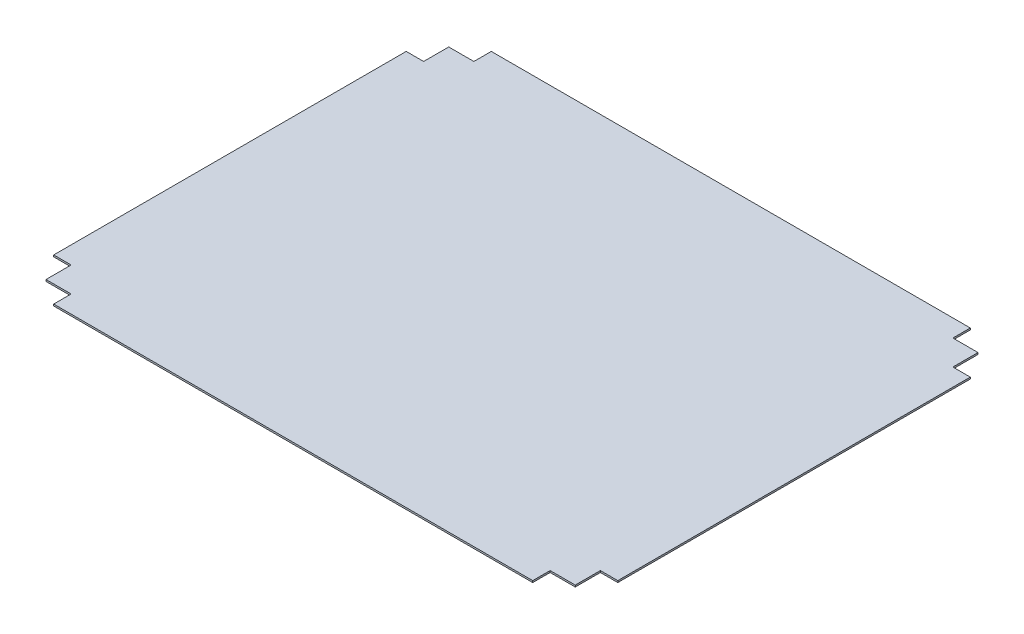
ISO-10303-21;
HEADER;
FILE_DESCRIPTION(('STEP AP214'),'2;1');
FILE_NAME('part.step','',(''),(''),'','','');
FILE_SCHEMA(('AUTOMOTIVE_DESIGN { 1 0 10303 214 1 1 1 1 }'));
ENDSEC;
DATA;
#1=APPLICATION_CONTEXT('core data for automotive mechanical design processes');
#2=APPLICATION_PROTOCOL_DEFINITION('international standard','automotive_design',2000,#1);
#3=PRODUCT_CONTEXT('',#1,'mechanical');
#4=PRODUCT('Part','Part','',(#3));
#5=PRODUCT_RELATED_PRODUCT_CATEGORY('part','',(#4));
#6=PRODUCT_DEFINITION_FORMATION('','',#4);
#7=PRODUCT_DEFINITION_CONTEXT('part definition',#1,'design');
#8=PRODUCT_DEFINITION('design','',#6,#7);
#9=PRODUCT_DEFINITION_SHAPE('','',#8);
#10=(LENGTH_UNIT() NAMED_UNIT(*) SI_UNIT(.MILLI.,.METRE.));
#11=(NAMED_UNIT(*) PLANE_ANGLE_UNIT() SI_UNIT($,.RADIAN.));
#12=(NAMED_UNIT(*) SI_UNIT($,.STERADIAN.) SOLID_ANGLE_UNIT());
#13=UNCERTAINTY_MEASURE_WITH_UNIT(LENGTH_MEASURE(1.E-05),#10,'distance_accuracy_value','');
#14=(GEOMETRIC_REPRESENTATION_CONTEXT(3) GLOBAL_UNCERTAINTY_ASSIGNED_CONTEXT((#13)) GLOBAL_UNIT_ASSIGNED_CONTEXT((#10,
#11,#12)) REPRESENTATION_CONTEXT('',''));
#15=CARTESIAN_POINT('',(0.,0.,0.));
#16=DIRECTION('',(0.,0.,1.));
#17=DIRECTION('',(1.,0.,0.));
#18=AXIS2_PLACEMENT_3D('',#15,#16,#17);
#19=CARTESIAN_POINT('',(276.401533303744,2.,252.500218509708));
#20=DIRECTION('',(0.,0.,-1.));
#21=DIRECTION('',(-1.,0.,0.));
#22=AXIS2_PLACEMENT_3D('',#19,#20,#21);
#23=PLANE('',#22);
#24=DIRECTION('',(1.,0.,0.));
#25=VECTOR('',#24,1.);
#26=CARTESIAN_POINT('',(276.401533303744,0.,252.500218509708));
#27=LINE('',#26,#25);
#28=CARTESIAN_POINT('',(-276.399781490292,0.,252.500218509709));
#29=VERTEX_POINT('',#28);
#30=CARTESIAN_POINT('',(276.401533303744,0.,252.500218509708));
#31=VERTEX_POINT('',#30);
#32=EDGE_CURVE('E201',#29,#31,#27,.T.);
#33=ORIENTED_EDGE('',*,*,#32,.T.);
#34=DIRECTION('',(0.,-1.,0.));
#35=VECTOR('',#34,1.);
#36=CARTESIAN_POINT('',(276.401533303744,2.,252.500218509708));
#37=LINE('',#36,#35);
#38=CARTESIAN_POINT('',(276.401533303744,2.,252.500218509708));
#39=VERTEX_POINT('',#38);
#40=EDGE_CURVE('E11',#39,#31,#37,.T.);
#41=ORIENTED_EDGE('',*,*,#40,.F.);
#42=DIRECTION('',(1.,0.,0.));
#43=VECTOR('',#42,1.);
#44=CARTESIAN_POINT('',(276.401533303744,2.,252.500218509708));
#45=LINE('',#44,#43);
#46=CARTESIAN_POINT('',(-276.399781490292,2.,252.500218509709));
#47=VERTEX_POINT('',#46);
#48=EDGE_CURVE('E239',#47,#39,#45,.T.);
#49=ORIENTED_EDGE('',*,*,#48,.F.);
#50=DIRECTION('',(0.,-1.,0.));
#51=VECTOR('',#50,1.);
#52=CARTESIAN_POINT('',(-276.399781490292,2.,252.500218509709));
#53=LINE('',#52,#51);
#54=EDGE_CURVE('E197',#47,#29,#53,.T.);
#55=ORIENTED_EDGE('',*,*,#54,.T.);
#56=EDGE_LOOP('',(#33,#41,#49,#55));
#57=FACE_BOUND('',#56,.T.);
#58=ADVANCED_FACE('F33',(#57),#23,.F.);
#59=CARTESIAN_POINT('',(276.401533303744,2.,232.401081901545));
#60=DIRECTION('',(-1.,0.,0.));
#61=DIRECTION('',(0.,0.,1.));
#62=AXIS2_PLACEMENT_3D('',#59,#60,#61);
#63=PLANE('',#62);
#64=DIRECTION('',(0.,0.,-1.));
#65=VECTOR('',#64,1.);
#66=CARTESIAN_POINT('',(276.401533303744,0.,232.401081901545));
#67=LINE('',#66,#65);
#68=CARTESIAN_POINT('',(276.401533303744,0.,232.401081901545));
#69=VERTEX_POINT('',#68);
#70=EDGE_CURVE('E204',#31,#69,#67,.T.);
#71=ORIENTED_EDGE('',*,*,#70,.T.);
#72=DIRECTION('',(0.,-1.,0.));
#73=VECTOR('',#72,1.);
#74=CARTESIAN_POINT('',(276.401533303744,2.,232.401081901545));
#75=LINE('',#74,#73);
#76=CARTESIAN_POINT('',(276.401533303744,2.,232.401081901545));
#77=VERTEX_POINT('',#76);
#78=EDGE_CURVE('E41',#77,#69,#75,.T.);
#79=ORIENTED_EDGE('',*,*,#78,.F.);
#80=DIRECTION('',(0.,0.,-1.));
#81=VECTOR('',#80,1.);
#82=CARTESIAN_POINT('',(276.401533303744,2.,232.401081901545));
#83=LINE('',#82,#81);
#84=EDGE_CURVE('E128',#39,#77,#83,.T.);
#85=ORIENTED_EDGE('',*,*,#84,.F.);
#86=ORIENTED_EDGE('',*,*,#40,.T.);
#87=EDGE_LOOP('',(#71,#79,#85,#86));
#88=FACE_BOUND('',#87,.T.);
#89=ADVANCED_FACE('F357',(#88),#63,.F.);
#90=CARTESIAN_POINT('',(305.401533303744,2.,232.401081901545));
#91=DIRECTION('',(0.,0.,-1.));
#92=DIRECTION('',(-1.,0.,0.));
#93=AXIS2_PLACEMENT_3D('',#90,#91,#92);
#94=PLANE('',#93);
#95=DIRECTION('',(1.,0.,0.));
#96=VECTOR('',#95,1.);
#97=CARTESIAN_POINT('',(305.401533303744,0.,232.401081901545));
#98=LINE('',#97,#96);
#99=CARTESIAN_POINT('',(305.401533303744,0.,232.401081901545));
#100=VERTEX_POINT('',#99);
#101=EDGE_CURVE('E206',#69,#100,#98,.T.);
#102=ORIENTED_EDGE('',*,*,#101,.T.);
#103=DIRECTION('',(0.,-1.,0.));
#104=VECTOR('',#103,1.);
#105=CARTESIAN_POINT('',(305.401533303744,2.,232.401081901545));
#106=LINE('',#105,#104);
#107=CARTESIAN_POINT('',(305.401533303744,2.,232.401081901545));
#108=VERTEX_POINT('',#107);
#109=EDGE_CURVE('E282',#108,#100,#106,.T.);
#110=ORIENTED_EDGE('',*,*,#109,.F.);
#111=DIRECTION('',(1.,0.,0.));
#112=VECTOR('',#111,1.);
#113=CARTESIAN_POINT('',(305.401533303744,2.,232.401081901545));
#114=LINE('',#113,#112);
#115=EDGE_CURVE('E290',#77,#108,#114,.T.);
#116=ORIENTED_EDGE('',*,*,#115,.F.);
#117=ORIENTED_EDGE('',*,*,#78,.T.);
#118=EDGE_LOOP('',(#102,#110,#116,#117));
#119=FACE_BOUND('',#118,.T.);
#120=ADVANCED_FACE('F288',(#119),#94,.F.);
#121=CARTESIAN_POINT('',(305.401533303744,2.,203.401081901545));
#122=DIRECTION('',(-1.,0.,0.));
#123=DIRECTION('',(0.,0.,1.));
#124=AXIS2_PLACEMENT_3D('',#121,#122,#123);
#125=PLANE('',#124);
#126=DIRECTION('',(0.,0.,-1.));
#127=VECTOR('',#126,1.);
#128=CARTESIAN_POINT('',(305.401533303744,0.,203.401081901545));
#129=LINE('',#128,#127);
#130=CARTESIAN_POINT('',(305.401533303744,0.,203.401081901545));
#131=VERTEX_POINT('',#130);
#132=EDGE_CURVE('E208',#100,#131,#129,.T.);
#133=ORIENTED_EDGE('',*,*,#132,.T.);
#134=DIRECTION('',(0.,-1.,0.));
#135=VECTOR('',#134,1.);
#136=CARTESIAN_POINT('',(305.401533303744,2.,203.401081901545));
#137=LINE('',#136,#135);
#138=CARTESIAN_POINT('',(305.401533303744,2.,203.401081901545));
#139=VERTEX_POINT('',#138);
#140=EDGE_CURVE('E279',#139,#131,#137,.T.);
#141=ORIENTED_EDGE('',*,*,#140,.F.);
#142=DIRECTION('',(0.,0.,-1.));
#143=VECTOR('',#142,1.);
#144=CARTESIAN_POINT('',(305.401533303744,2.,203.401081901545));
#145=LINE('',#144,#143);
#146=EDGE_CURVE('E308',#108,#139,#145,.T.);
#147=ORIENTED_EDGE('',*,*,#146,.F.);
#148=ORIENTED_EDGE('',*,*,#109,.T.);
#149=EDGE_LOOP('',(#133,#141,#147,#148));
#150=FACE_BOUND('',#149,.T.);
#151=ADVANCED_FACE('F299',(#150),#125,.F.);
#152=CARTESIAN_POINT('',(325.500218509709,2.,203.401081901545));
#153=DIRECTION('',(0.,0.,-1.));
#154=DIRECTION('',(-1.,0.,0.));
#155=AXIS2_PLACEMENT_3D('',#152,#153,#154);
#156=PLANE('',#155);
#157=DIRECTION('',(1.,0.,0.));
#158=VECTOR('',#157,1.);
#159=CARTESIAN_POINT('',(325.500218509709,0.,203.401081901545));
#160=LINE('',#159,#158);
#161=CARTESIAN_POINT('',(325.500218509709,0.,203.401081901545));
#162=VERTEX_POINT('',#161);
#163=EDGE_CURVE('E210',#131,#162,#160,.T.);
#164=ORIENTED_EDGE('',*,*,#163,.T.);
#165=DIRECTION('',(0.,-1.,0.));
#166=VECTOR('',#165,1.);
#167=CARTESIAN_POINT('',(325.500218509709,2.,203.401081901545));
#168=LINE('',#167,#166);
#169=CARTESIAN_POINT('',(325.500218509709,2.,203.401081901545));
#170=VERTEX_POINT('',#169);
#171=EDGE_CURVE('E276',#170,#162,#168,.T.);
#172=ORIENTED_EDGE('',*,*,#171,.F.);
#173=DIRECTION('',(1.,0.,0.));
#174=VECTOR('',#173,1.);
#175=CARTESIAN_POINT('',(325.500218509709,2.,203.401081901545));
#176=LINE('',#175,#174);
#177=EDGE_CURVE('E305',#139,#170,#176,.T.);
#178=ORIENTED_EDGE('',*,*,#177,.F.);
#179=ORIENTED_EDGE('',*,*,#140,.T.);
#180=EDGE_LOOP('',(#164,#172,#178,#179));
#181=FACE_BOUND('',#180,.T.);
#182=ADVANCED_FACE('F303',(#181),#156,.F.);
#183=CARTESIAN_POINT('',(325.500218509708,2.,-203.401101301539));
#184=DIRECTION('',(-1.,0.,0.));
#185=DIRECTION('',(0.,0.,1.));
#186=AXIS2_PLACEMENT_3D('',#183,#184,#185);
#187=PLANE('',#186);
#188=DIRECTION('',(0.,0.,-1.));
#189=VECTOR('',#188,1.);
#190=CARTESIAN_POINT('',(325.500218509708,0.,-203.401101301539));
#191=LINE('',#190,#189);
#192=CARTESIAN_POINT('',(325.500218509708,0.,-203.401101301539));
#193=VERTEX_POINT('',#192);
#194=EDGE_CURVE('E212',#162,#193,#191,.T.);
#195=ORIENTED_EDGE('',*,*,#194,.T.);
#196=DIRECTION('',(0.,-1.,0.));
#197=VECTOR('',#196,1.);
#198=CARTESIAN_POINT('',(325.500218509708,2.,-203.401101301539));
#199=LINE('',#198,#197);
#200=CARTESIAN_POINT('',(325.500218509708,2.,-203.401101301539));
#201=VERTEX_POINT('',#200);
#202=EDGE_CURVE('E273',#201,#193,#199,.T.);
#203=ORIENTED_EDGE('',*,*,#202,.F.);
#204=DIRECTION('',(0.,0.,-1.));
#205=VECTOR('',#204,1.);
#206=CARTESIAN_POINT('',(325.500218509708,2.,-203.401101301539));
#207=LINE('',#206,#205);
#208=EDGE_CURVE('E307',#170,#201,#207,.T.);
#209=ORIENTED_EDGE('',*,*,#208,.F.);
#210=ORIENTED_EDGE('',*,*,#171,.T.);
#211=EDGE_LOOP('',(#195,#203,#209,#210));
#212=FACE_BOUND('',#211,.T.);
#213=ADVANCED_FACE('F370',(#212),#187,.F.);
#214=CARTESIAN_POINT('',(305.401533303743,2.,-203.401101301539));
#215=DIRECTION('',(0.,0.,1.));
#216=DIRECTION('',(1.,0.,0.));
#217=AXIS2_PLACEMENT_3D('',#214,#215,#216);
#218=PLANE('',#217);
#219=DIRECTION('',(-1.,0.,0.));
#220=VECTOR('',#219,1.);
#221=CARTESIAN_POINT('',(305.401533303743,0.,-203.401101301539));
#222=LINE('',#221,#220);
#223=CARTESIAN_POINT('',(305.401533303743,0.,-203.401101301539));
#224=VERTEX_POINT('',#223);
#225=EDGE_CURVE('E214',#193,#224,#222,.T.);
#226=ORIENTED_EDGE('',*,*,#225,.T.);
#227=DIRECTION('',(0.,-1.,0.));
#228=VECTOR('',#227,1.);
#229=CARTESIAN_POINT('',(305.401533303743,2.,-203.401101301539));
#230=LINE('',#229,#228);
#231=CARTESIAN_POINT('',(305.401533303743,2.,-203.401101301539));
#232=VERTEX_POINT('',#231);
#233=EDGE_CURVE('E270',#232,#224,#230,.T.);
#234=ORIENTED_EDGE('',*,*,#233,.F.);
#235=DIRECTION('',(-1.,0.,0.));
#236=VECTOR('',#235,1.);
#237=CARTESIAN_POINT('',(305.401533303743,2.,-203.401101301539));
#238=LINE('',#237,#236);
#239=EDGE_CURVE('E310',#201,#232,#238,.T.);
#240=ORIENTED_EDGE('',*,*,#239,.F.);
#241=ORIENTED_EDGE('',*,*,#202,.T.);
#242=EDGE_LOOP('',(#226,#234,#240,#241));
#243=FACE_BOUND('',#242,.T.);
#244=ADVANCED_FACE('F373',(#243),#218,.F.);
#245=CARTESIAN_POINT('',(305.401533303743,2.,-232.401101301539));
#246=DIRECTION('',(-1.,0.,0.));
#247=DIRECTION('',(0.,0.,1.));
#248=AXIS2_PLACEMENT_3D('',#245,#246,#247);
#249=PLANE('',#248);
#250=DIRECTION('',(0.,0.,-1.));
#251=VECTOR('',#250,1.);
#252=CARTESIAN_POINT('',(305.401533303743,0.,-232.401101301539));
#253=LINE('',#252,#251);
#254=CARTESIAN_POINT('',(305.401533303743,0.,-232.401101301539));
#255=VERTEX_POINT('',#254);
#256=EDGE_CURVE('E216',#224,#255,#253,.T.);
#257=ORIENTED_EDGE('',*,*,#256,.T.);
#258=DIRECTION('',(0.,-1.,0.));
#259=VECTOR('',#258,1.);
#260=CARTESIAN_POINT('',(305.401533303743,2.,-232.401101301539));
#261=LINE('',#260,#259);
#262=CARTESIAN_POINT('',(305.401533303743,2.,-232.401101301539));
#263=VERTEX_POINT('',#262);
#264=EDGE_CURVE('E267',#263,#255,#261,.T.);
#265=ORIENTED_EDGE('',*,*,#264,.F.);
#266=DIRECTION('',(0.,0.,-1.));
#267=VECTOR('',#266,1.);
#268=CARTESIAN_POINT('',(305.401533303743,2.,-232.401101301539));
#269=LINE('',#268,#267);
#270=EDGE_CURVE('E316',#232,#263,#269,.T.);
#271=ORIENTED_EDGE('',*,*,#270,.F.);
#272=ORIENTED_EDGE('',*,*,#233,.T.);
#273=EDGE_LOOP('',(#257,#265,#271,#272));
#274=FACE_BOUND('',#273,.T.);
#275=ADVANCED_FACE('F377',(#274),#249,.F.);
#276=CARTESIAN_POINT('',(276.401533303743,2.,-232.401101301539));
#277=DIRECTION('',(0.,0.,1.));
#278=DIRECTION('',(1.,0.,0.));
#279=AXIS2_PLACEMENT_3D('',#276,#277,#278);
#280=PLANE('',#279);
#281=DIRECTION('',(-1.,0.,0.));
#282=VECTOR('',#281,1.);
#283=CARTESIAN_POINT('',(276.401533303743,0.,-232.401101301539));
#284=LINE('',#283,#282);
#285=CARTESIAN_POINT('',(276.401533303743,0.,-232.401101301539));
#286=VERTEX_POINT('',#285);
#287=EDGE_CURVE('E218',#255,#286,#284,.T.);
#288=ORIENTED_EDGE('',*,*,#287,.T.);
#289=DIRECTION('',(0.,-1.,0.));
#290=VECTOR('',#289,1.);
#291=CARTESIAN_POINT('',(276.401533303743,2.,-232.401101301539));
#292=LINE('',#291,#290);
#293=CARTESIAN_POINT('',(276.401533303743,2.,-232.401101301539));
#294=VERTEX_POINT('',#293);
#295=EDGE_CURVE('E264',#294,#286,#292,.T.);
#296=ORIENTED_EDGE('',*,*,#295,.F.);
#297=DIRECTION('',(-1.,0.,0.));
#298=VECTOR('',#297,1.);
#299=CARTESIAN_POINT('',(276.401533303743,2.,-232.401101301539));
#300=LINE('',#299,#298);
#301=EDGE_CURVE('E318',#263,#294,#300,.T.);
#302=ORIENTED_EDGE('',*,*,#301,.F.);
#303=ORIENTED_EDGE('',*,*,#264,.T.);
#304=EDGE_LOOP('',(#288,#296,#302,#303));
#305=FACE_BOUND('',#304,.T.);
#306=ADVANCED_FACE('F381',(#305),#280,.F.);
#307=CARTESIAN_POINT('',(276.401533303744,2.,-252.500218509708));
#308=DIRECTION('',(-1.,0.,0.));
#309=DIRECTION('',(0.,0.,1.));
#310=AXIS2_PLACEMENT_3D('',#307,#308,#309);
#311=PLANE('',#310);
#312=DIRECTION('',(0.,0.,-1.));
#313=VECTOR('',#312,1.);
#314=CARTESIAN_POINT('',(276.401533303744,0.,-252.500218509708));
#315=LINE('',#314,#313);
#316=CARTESIAN_POINT('',(276.401533303744,0.,-252.500218509708));
#317=VERTEX_POINT('',#316);
#318=EDGE_CURVE('E220',#286,#317,#315,.T.);
#319=ORIENTED_EDGE('',*,*,#318,.T.);
#320=DIRECTION('',(0.,-1.,0.));
#321=VECTOR('',#320,1.);
#322=CARTESIAN_POINT('',(276.401533303744,2.,-252.500218509708));
#323=LINE('',#322,#321);
#324=CARTESIAN_POINT('',(276.401533303744,2.,-252.500218509708));
#325=VERTEX_POINT('',#324);
#326=EDGE_CURVE('E261',#325,#317,#323,.T.);
#327=ORIENTED_EDGE('',*,*,#326,.F.);
#328=DIRECTION('',(0.,0.,-1.));
#329=VECTOR('',#328,1.);
#330=CARTESIAN_POINT('',(276.401533303744,2.,-252.500218509708));
#331=LINE('',#330,#329);
#332=EDGE_CURVE('E320',#294,#325,#331,.T.);
#333=ORIENTED_EDGE('',*,*,#332,.F.);
#334=ORIENTED_EDGE('',*,*,#295,.T.);
#335=EDGE_LOOP('',(#319,#327,#333,#334));
#336=FACE_BOUND('',#335,.T.);
#337=ADVANCED_FACE('F385',(#336),#311,.F.);
#338=CARTESIAN_POINT('',(-276.399781490292,2.,-252.500218509708));
#339=DIRECTION('',(0.,0.,1.));
#340=DIRECTION('',(1.,0.,0.));
#341=AXIS2_PLACEMENT_3D('',#338,#339,#340);
#342=PLANE('',#341);
#343=DIRECTION('',(-1.,0.,0.));
#344=VECTOR('',#343,1.);
#345=CARTESIAN_POINT('',(-276.399781490292,0.,-252.500218509708));
#346=LINE('',#345,#344);
#347=CARTESIAN_POINT('',(-276.399781490292,0.,-252.500218509708));
#348=VERTEX_POINT('',#347);
#349=EDGE_CURVE('E222',#317,#348,#346,.T.);
#350=ORIENTED_EDGE('',*,*,#349,.T.);
#351=DIRECTION('',(0.,-1.,0.));
#352=VECTOR('',#351,1.);
#353=CARTESIAN_POINT('',(-276.399781490292,2.,-252.500218509708));
#354=LINE('',#353,#352);
#355=CARTESIAN_POINT('',(-276.399781490292,2.,-252.500218509708));
#356=VERTEX_POINT('',#355);
#357=EDGE_CURVE('E258',#356,#348,#354,.T.);
#358=ORIENTED_EDGE('',*,*,#357,.F.);
#359=DIRECTION('',(-1.,0.,0.));
#360=VECTOR('',#359,1.);
#361=CARTESIAN_POINT('',(-276.399781490292,2.,-252.500218509708));
#362=LINE('',#361,#360);
#363=EDGE_CURVE('E322',#325,#356,#362,.T.);
#364=ORIENTED_EDGE('',*,*,#363,.F.);
#365=ORIENTED_EDGE('',*,*,#326,.T.);
#366=EDGE_LOOP('',(#350,#358,#364,#365));
#367=FACE_BOUND('',#366,.T.);
#368=ADVANCED_FACE('F389',(#367),#342,.F.);
#369=CARTESIAN_POINT('',(-276.399781490292,2.,-232.401101301539));
#370=DIRECTION('',(1.,0.,0.));
#371=DIRECTION('',(0.,0.,-1.));
#372=AXIS2_PLACEMENT_3D('',#369,#370,#371);
#373=PLANE('',#372);
#374=DIRECTION('',(0.,0.,1.));
#375=VECTOR('',#374,1.);
#376=CARTESIAN_POINT('',(-276.399781490292,0.,-232.401101301539));
#377=LINE('',#376,#375);
#378=CARTESIAN_POINT('',(-276.399781490292,0.,-232.401101301539));
#379=VERTEX_POINT('',#378);
#380=EDGE_CURVE('E224',#348,#379,#377,.T.);
#381=ORIENTED_EDGE('',*,*,#380,.T.);
#382=DIRECTION('',(0.,-1.,0.));
#383=VECTOR('',#382,1.);
#384=CARTESIAN_POINT('',(-276.399781490292,2.,-232.401101301539));
#385=LINE('',#384,#383);
#386=CARTESIAN_POINT('',(-276.399781490292,2.,-232.401101301539));
#387=VERTEX_POINT('',#386);
#388=EDGE_CURVE('E255',#387,#379,#385,.T.);
#389=ORIENTED_EDGE('',*,*,#388,.F.);
#390=DIRECTION('',(0.,0.,1.));
#391=VECTOR('',#390,1.);
#392=CARTESIAN_POINT('',(-276.399781490292,2.,-232.401101301539));
#393=LINE('',#392,#391);
#394=EDGE_CURVE('E324',#356,#387,#393,.T.);
#395=ORIENTED_EDGE('',*,*,#394,.F.);
#396=ORIENTED_EDGE('',*,*,#357,.T.);
#397=EDGE_LOOP('',(#381,#389,#395,#396));
#398=FACE_BOUND('',#397,.T.);
#399=ADVANCED_FACE('F393',(#398),#373,.F.);
#400=CARTESIAN_POINT('',(-305.399781490292,2.,-232.401101301539));
#401=DIRECTION('',(0.,0.,1.));
#402=DIRECTION('',(1.,0.,0.));
#403=AXIS2_PLACEMENT_3D('',#400,#401,#402);
#404=PLANE('',#403);
#405=DIRECTION('',(-1.,0.,0.));
#406=VECTOR('',#405,1.);
#407=CARTESIAN_POINT('',(-305.399781490292,0.,-232.401101301539));
#408=LINE('',#407,#406);
#409=CARTESIAN_POINT('',(-305.399781490292,0.,-232.401101301539));
#410=VERTEX_POINT('',#409);
#411=EDGE_CURVE('E226',#379,#410,#408,.T.);
#412=ORIENTED_EDGE('',*,*,#411,.T.);
#413=DIRECTION('',(0.,-1.,0.));
#414=VECTOR('',#413,1.);
#415=CARTESIAN_POINT('',(-305.399781490292,2.,-232.401101301539));
#416=LINE('',#415,#414);
#417=CARTESIAN_POINT('',(-305.399781490292,2.,-232.401101301539));
#418=VERTEX_POINT('',#417);
#419=EDGE_CURVE('E252',#418,#410,#416,.T.);
#420=ORIENTED_EDGE('',*,*,#419,.F.);
#421=DIRECTION('',(-1.,0.,0.));
#422=VECTOR('',#421,1.);
#423=CARTESIAN_POINT('',(-305.399781490292,2.,-232.401101301539));
#424=LINE('',#423,#422);
#425=EDGE_CURVE('E326',#387,#418,#424,.T.);
#426=ORIENTED_EDGE('',*,*,#425,.F.);
#427=ORIENTED_EDGE('',*,*,#388,.T.);
#428=EDGE_LOOP('',(#412,#420,#426,#427));
#429=FACE_BOUND('',#428,.T.);
#430=ADVANCED_FACE('F397',(#429),#404,.F.);
#431=CARTESIAN_POINT('',(-305.399781490292,2.,-203.401101301539));
#432=DIRECTION('',(1.,0.,0.));
#433=DIRECTION('',(0.,0.,-1.));
#434=AXIS2_PLACEMENT_3D('',#431,#432,#433);
#435=PLANE('',#434);
#436=DIRECTION('',(0.,0.,1.));
#437=VECTOR('',#436,1.);
#438=CARTESIAN_POINT('',(-305.399781490292,0.,-203.401101301539));
#439=LINE('',#438,#437);
#440=CARTESIAN_POINT('',(-305.399781490292,0.,-203.401101301539));
#441=VERTEX_POINT('',#440);
#442=EDGE_CURVE('E228',#410,#441,#439,.T.);
#443=ORIENTED_EDGE('',*,*,#442,.T.);
#444=DIRECTION('',(0.,-1.,0.));
#445=VECTOR('',#444,1.);
#446=CARTESIAN_POINT('',(-305.399781490292,2.,-203.401101301539));
#447=LINE('',#446,#445);
#448=CARTESIAN_POINT('',(-305.399781490292,2.,-203.401101301539));
#449=VERTEX_POINT('',#448);
#450=EDGE_CURVE('E249',#449,#441,#447,.T.);
#451=ORIENTED_EDGE('',*,*,#450,.F.);
#452=DIRECTION('',(0.,0.,1.));
#453=VECTOR('',#452,1.);
#454=CARTESIAN_POINT('',(-305.399781490292,2.,-203.401101301539));
#455=LINE('',#454,#453);
#456=EDGE_CURVE('E328',#418,#449,#455,.T.);
#457=ORIENTED_EDGE('',*,*,#456,.F.);
#458=ORIENTED_EDGE('',*,*,#419,.T.);
#459=EDGE_LOOP('',(#443,#451,#457,#458));
#460=FACE_BOUND('',#459,.T.);
#461=ADVANCED_FACE('F401',(#460),#435,.F.);
#462=CARTESIAN_POINT('',(-325.500218509709,2.,-203.401101301539));
#463=DIRECTION('',(0.,0.,1.));
#464=DIRECTION('',(1.,0.,0.));
#465=AXIS2_PLACEMENT_3D('',#462,#463,#464);
#466=PLANE('',#465);
#467=DIRECTION('',(-1.,0.,0.));
#468=VECTOR('',#467,1.);
#469=CARTESIAN_POINT('',(-325.500218509709,0.,-203.401101301539));
#470=LINE('',#469,#468);
#471=CARTESIAN_POINT('',(-325.500218509709,0.,-203.401101301539));
#472=VERTEX_POINT('',#471);
#473=EDGE_CURVE('E230',#441,#472,#470,.T.);
#474=ORIENTED_EDGE('',*,*,#473,.T.);
#475=DIRECTION('',(0.,-1.,0.));
#476=VECTOR('',#475,1.);
#477=CARTESIAN_POINT('',(-325.500218509709,2.,-203.401101301539));
#478=LINE('',#477,#476);
#479=CARTESIAN_POINT('',(-325.500218509709,2.,-203.401101301539));
#480=VERTEX_POINT('',#479);
#481=EDGE_CURVE('E246',#480,#472,#478,.T.);
#482=ORIENTED_EDGE('',*,*,#481,.F.);
#483=DIRECTION('',(-1.,0.,0.));
#484=VECTOR('',#483,1.);
#485=CARTESIAN_POINT('',(-325.500218509709,2.,-203.401101301539));
#486=LINE('',#485,#484);
#487=EDGE_CURVE('E330',#449,#480,#486,.T.);
#488=ORIENTED_EDGE('',*,*,#487,.F.);
#489=ORIENTED_EDGE('',*,*,#450,.T.);
#490=EDGE_LOOP('',(#474,#482,#488,#489));
#491=FACE_BOUND('',#490,.T.);
#492=ADVANCED_FACE('F405',(#491),#466,.F.);
#493=CARTESIAN_POINT('',(-325.500218509708,2.,203.401081901545));
#494=DIRECTION('',(1.,0.,0.));
#495=DIRECTION('',(0.,0.,-1.));
#496=AXIS2_PLACEMENT_3D('',#493,#494,#495);
#497=PLANE('',#496);
#498=DIRECTION('',(0.,0.,1.));
#499=VECTOR('',#498,1.);
#500=CARTESIAN_POINT('',(-325.500218509708,0.,203.401081901545));
#501=LINE('',#500,#499);
#502=CARTESIAN_POINT('',(-325.500218509708,0.,203.401081901545));
#503=VERTEX_POINT('',#502);
#504=EDGE_CURVE('E232',#472,#503,#501,.T.);
#505=ORIENTED_EDGE('',*,*,#504,.T.);
#506=DIRECTION('',(0.,-1.,0.));
#507=VECTOR('',#506,1.);
#508=CARTESIAN_POINT('',(-325.500218509708,2.,203.401081901545));
#509=LINE('',#508,#507);
#510=CARTESIAN_POINT('',(-325.500218509708,2.,203.401081901545));
#511=VERTEX_POINT('',#510);
#512=EDGE_CURVE('E243',#511,#503,#509,.T.);
#513=ORIENTED_EDGE('',*,*,#512,.F.);
#514=DIRECTION('',(0.,0.,1.));
#515=VECTOR('',#514,1.);
#516=CARTESIAN_POINT('',(-325.500218509708,2.,203.401081901545));
#517=LINE('',#516,#515);
#518=EDGE_CURVE('E332',#480,#511,#517,.T.);
#519=ORIENTED_EDGE('',*,*,#518,.F.);
#520=ORIENTED_EDGE('',*,*,#481,.T.);
#521=EDGE_LOOP('',(#505,#513,#519,#520));
#522=FACE_BOUND('',#521,.T.);
#523=ADVANCED_FACE('F338',(#522),#497,.F.);
#524=CARTESIAN_POINT('',(-305.399781490292,2.,203.401081901545));
#525=DIRECTION('',(0.,0.,-1.));
#526=DIRECTION('',(-1.,0.,0.));
#527=AXIS2_PLACEMENT_3D('',#524,#525,#526);
#528=PLANE('',#527);
#529=DIRECTION('',(1.,0.,0.));
#530=VECTOR('',#529,1.);
#531=CARTESIAN_POINT('',(-305.399781490292,0.,203.401081901545));
#532=LINE('',#531,#530);
#533=CARTESIAN_POINT('',(-305.399781490292,0.,203.401081901545));
#534=VERTEX_POINT('',#533);
#535=EDGE_CURVE('E234',#503,#534,#532,.T.);
#536=ORIENTED_EDGE('',*,*,#535,.T.);
#537=DIRECTION('',(0.,-1.,0.));
#538=VECTOR('',#537,1.);
#539=CARTESIAN_POINT('',(-305.399781490292,2.,203.401081901545));
#540=LINE('',#539,#538);
#541=CARTESIAN_POINT('',(-305.399781490292,2.,203.401081901545));
#542=VERTEX_POINT('',#541);
#543=EDGE_CURVE('E192',#542,#534,#540,.T.);
#544=ORIENTED_EDGE('',*,*,#543,.F.);
#545=DIRECTION('',(1.,0.,0.));
#546=VECTOR('',#545,1.);
#547=CARTESIAN_POINT('',(-305.399781490292,2.,203.401081901545));
#548=LINE('',#547,#546);
#549=EDGE_CURVE('E183',#511,#542,#548,.T.);
#550=ORIENTED_EDGE('',*,*,#549,.F.);
#551=ORIENTED_EDGE('',*,*,#512,.T.);
#552=EDGE_LOOP('',(#536,#544,#550,#551));
#553=FACE_BOUND('',#552,.T.);
#554=ADVANCED_FACE('F342',(#553),#528,.F.);
#555=CARTESIAN_POINT('',(-305.399781490292,2.,232.401081901545));
#556=DIRECTION('',(1.,0.,0.));
#557=DIRECTION('',(0.,0.,-1.));
#558=AXIS2_PLACEMENT_3D('',#555,#556,#557);
#559=PLANE('',#558);
#560=DIRECTION('',(0.,0.,1.));
#561=VECTOR('',#560,1.);
#562=CARTESIAN_POINT('',(-305.399781490292,0.,232.401081901545));
#563=LINE('',#562,#561);
#564=CARTESIAN_POINT('',(-305.399781490292,0.,232.401081901545));
#565=VERTEX_POINT('',#564);
#566=EDGE_CURVE('E191',#534,#565,#563,.T.);
#567=ORIENTED_EDGE('',*,*,#566,.T.);
#568=DIRECTION('',(0.,-1.,0.));
#569=VECTOR('',#568,1.);
#570=CARTESIAN_POINT('',(-305.399781490292,2.,232.401081901545));
#571=LINE('',#570,#569);
#572=CARTESIAN_POINT('',(-305.399781490292,2.,232.401081901545));
#573=VERTEX_POINT('',#572);
#574=EDGE_CURVE('E188',#573,#565,#571,.T.);
#575=ORIENTED_EDGE('',*,*,#574,.F.);
#576=DIRECTION('',(0.,0.,1.));
#577=VECTOR('',#576,1.);
#578=CARTESIAN_POINT('',(-305.399781490292,2.,232.401081901545));
#579=LINE('',#578,#577);
#580=EDGE_CURVE('E177',#542,#573,#579,.T.);
#581=ORIENTED_EDGE('',*,*,#580,.F.);
#582=ORIENTED_EDGE('',*,*,#543,.T.);
#583=EDGE_LOOP('',(#567,#575,#581,#582));
#584=FACE_BOUND('',#583,.T.);
#585=ADVANCED_FACE('F189',(#584),#559,.F.);
#586=CARTESIAN_POINT('',(-276.399781490292,2.,232.401081901545));
#587=DIRECTION('',(0.,0.,-1.));
#588=DIRECTION('',(-1.,0.,0.));
#589=AXIS2_PLACEMENT_3D('',#586,#587,#588);
#590=PLANE('',#589);
#591=DIRECTION('',(1.,0.,0.));
#592=VECTOR('',#591,1.);
#593=CARTESIAN_POINT('',(-276.399781490292,0.,232.401081901545));
#594=LINE('',#593,#592);
#595=CARTESIAN_POINT('',(-276.399781490292,0.,232.401081901545));
#596=VERTEX_POINT('',#595);
#597=EDGE_CURVE('E114',#565,#596,#594,.T.);
#598=ORIENTED_EDGE('',*,*,#597,.T.);
#599=DIRECTION('',(0.,-1.,0.));
#600=VECTOR('',#599,1.);
#601=CARTESIAN_POINT('',(-276.399781490292,2.,232.401081901545));
#602=LINE('',#601,#600);
#603=CARTESIAN_POINT('',(-276.399781490292,2.,232.401081901545));
#604=VERTEX_POINT('',#603);
#605=EDGE_CURVE('E193',#604,#596,#602,.T.);
#606=ORIENTED_EDGE('',*,*,#605,.F.);
#607=DIRECTION('',(1.,0.,0.));
#608=VECTOR('',#607,1.);
#609=CARTESIAN_POINT('',(-276.399781490292,2.,232.401081901545));
#610=LINE('',#609,#608);
#611=EDGE_CURVE('E181',#573,#604,#610,.T.);
#612=ORIENTED_EDGE('',*,*,#611,.F.);
#613=ORIENTED_EDGE('',*,*,#574,.T.);
#614=EDGE_LOOP('',(#598,#606,#612,#613));
#615=FACE_BOUND('',#614,.T.);
#616=ADVANCED_FACE('F195',(#615),#590,.F.);
#617=CARTESIAN_POINT('',(-276.399781490292,2.,252.500218509709));
#618=DIRECTION('',(1.,0.,0.));
#619=DIRECTION('',(0.,0.,-1.));
#620=AXIS2_PLACEMENT_3D('',#617,#618,#619);
#621=PLANE('',#620);
#622=DIRECTION('',(0.,0.,1.));
#623=VECTOR('',#622,1.);
#624=CARTESIAN_POINT('',(-276.399781490292,0.,252.500218509709));
#625=LINE('',#624,#623);
#626=EDGE_CURVE('E120',#596,#29,#625,.T.);
#627=ORIENTED_EDGE('',*,*,#626,.T.);
#628=ORIENTED_EDGE('',*,*,#54,.F.);
#629=DIRECTION('',(0.,0.,1.));
#630=VECTOR('',#629,1.);
#631=CARTESIAN_POINT('',(-276.399781490292,2.,252.500218509709));
#632=LINE('',#631,#630);
#633=EDGE_CURVE('E49',#604,#47,#632,.T.);
#634=ORIENTED_EDGE('',*,*,#633,.F.);
#635=ORIENTED_EDGE('',*,*,#605,.T.);
#636=EDGE_LOOP('',(#627,#628,#634,#635));
#637=FACE_BOUND('',#636,.T.);
#638=ADVANCED_FACE('F346',(#637),#621,.F.);
#639=CARTESIAN_POINT('',(0.,2.,0.));
#640=DIRECTION('',(0.,-1.,0.));
#641=DIRECTION('',(0.,0.,-1.));
#642=AXIS2_PLACEMENT_3D('',#639,#640,#641);
#643=PLANE('',#642);
#644=ORIENTED_EDGE('',*,*,#48,.T.);
#645=ORIENTED_EDGE('',*,*,#84,.T.);
#646=ORIENTED_EDGE('',*,*,#115,.T.);
#647=ORIENTED_EDGE('',*,*,#146,.T.);
#648=ORIENTED_EDGE('',*,*,#177,.T.);
#649=ORIENTED_EDGE('',*,*,#208,.T.);
#650=ORIENTED_EDGE('',*,*,#239,.T.);
#651=ORIENTED_EDGE('',*,*,#270,.T.);
#652=ORIENTED_EDGE('',*,*,#301,.T.);
#653=ORIENTED_EDGE('',*,*,#332,.T.);
#654=ORIENTED_EDGE('',*,*,#363,.T.);
#655=ORIENTED_EDGE('',*,*,#394,.T.);
#656=ORIENTED_EDGE('',*,*,#425,.T.);
#657=ORIENTED_EDGE('',*,*,#456,.T.);
#658=ORIENTED_EDGE('',*,*,#487,.T.);
#659=ORIENTED_EDGE('',*,*,#518,.T.);
#660=ORIENTED_EDGE('',*,*,#549,.T.);
#661=ORIENTED_EDGE('',*,*,#580,.T.);
#662=ORIENTED_EDGE('',*,*,#611,.T.);
#663=ORIENTED_EDGE('',*,*,#633,.T.);
#664=EDGE_LOOP('',(#644,#645,#646,#647,#648,#649,#650,#651,#652,#653,#654,#655,#656,#657,#658,
#659,#660,#661,#662,#663));
#665=FACE_BOUND('',#664,.T.);
#666=ADVANCED_FACE('F179',(#665),#643,.F.);
#667=CARTESIAN_POINT('',(0.,0.,0.));
#668=DIRECTION('',(0.,-1.,0.));
#669=DIRECTION('',(0.,0.,-1.));
#670=AXIS2_PLACEMENT_3D('',#667,#668,#669);
#671=PLANE('',#670);
#672=ORIENTED_EDGE('',*,*,#32,.F.);
#673=ORIENTED_EDGE('',*,*,#626,.F.);
#674=ORIENTED_EDGE('',*,*,#597,.F.);
#675=ORIENTED_EDGE('',*,*,#566,.F.);
#676=ORIENTED_EDGE('',*,*,#535,.F.);
#677=ORIENTED_EDGE('',*,*,#504,.F.);
#678=ORIENTED_EDGE('',*,*,#473,.F.);
#679=ORIENTED_EDGE('',*,*,#442,.F.);
#680=ORIENTED_EDGE('',*,*,#411,.F.);
#681=ORIENTED_EDGE('',*,*,#380,.F.);
#682=ORIENTED_EDGE('',*,*,#349,.F.);
#683=ORIENTED_EDGE('',*,*,#318,.F.);
#684=ORIENTED_EDGE('',*,*,#287,.F.);
#685=ORIENTED_EDGE('',*,*,#256,.F.);
#686=ORIENTED_EDGE('',*,*,#225,.F.);
#687=ORIENTED_EDGE('',*,*,#194,.F.);
#688=ORIENTED_EDGE('',*,*,#163,.F.);
#689=ORIENTED_EDGE('',*,*,#132,.F.);
#690=ORIENTED_EDGE('',*,*,#101,.F.);
#691=ORIENTED_EDGE('',*,*,#70,.F.);
#692=EDGE_LOOP('',(#672,#673,#674,#675,#676,#677,#678,#679,#680,#681,#682,#683,#684,#685,#686,
#687,#688,#689,#690,#691));
#693=FACE_BOUND('',#692,.T.);
#694=ADVANCED_FACE('F294',(#693),#671,.T.);
#695=CLOSED_SHELL('',(#58,#89,#120,#151,#182,#213,#244,#275,#306,#337,#368,#399,#430,#461,#492,
#523,#554,#585,#616,#638,#666,#694));
#696=MANIFOLD_SOLID_BREP('B2',#695);
#697=ADVANCED_BREP_SHAPE_REPRESENTATION('',(#18,#696),#14);
#698=SHAPE_DEFINITION_REPRESENTATION(#9,#697);
ENDSEC;
END-ISO-10303-21;
